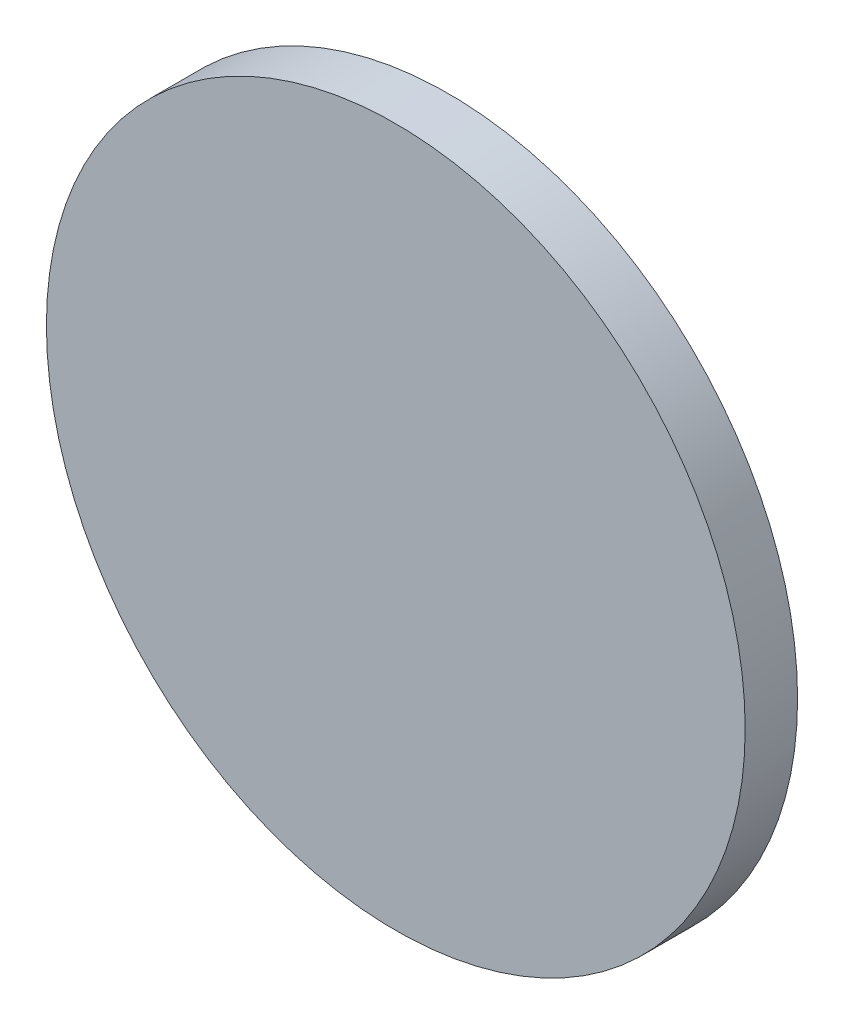
ISO-10303-21;
HEADER;
FILE_DESCRIPTION(('STEP AP214'),'2;1');
FILE_NAME('part.step','',(''),(''),'','','');
FILE_SCHEMA(('AUTOMOTIVE_DESIGN { 1 0 10303 214 1 1 1 1 }'));
ENDSEC;
DATA;
#1=APPLICATION_CONTEXT('core data for automotive mechanical design processes');
#2=APPLICATION_PROTOCOL_DEFINITION('international standard','automotive_design',2000,#1);
#3=PRODUCT_CONTEXT('',#1,'mechanical');
#4=PRODUCT('Part','Part','',(#3));
#5=PRODUCT_RELATED_PRODUCT_CATEGORY('part','',(#4));
#6=PRODUCT_DEFINITION_FORMATION('','',#4);
#7=PRODUCT_DEFINITION_CONTEXT('part definition',#1,'design');
#8=PRODUCT_DEFINITION('design','',#6,#7);
#9=PRODUCT_DEFINITION_SHAPE('','',#8);
#10=(LENGTH_UNIT() NAMED_UNIT(*) SI_UNIT(.MILLI.,.METRE.));
#11=(NAMED_UNIT(*) PLANE_ANGLE_UNIT() SI_UNIT($,.RADIAN.));
#12=(NAMED_UNIT(*) SI_UNIT($,.STERADIAN.) SOLID_ANGLE_UNIT());
#13=UNCERTAINTY_MEASURE_WITH_UNIT(LENGTH_MEASURE(1.E-05),#10,'distance_accuracy_value','');
#14=(GEOMETRIC_REPRESENTATION_CONTEXT(3) GLOBAL_UNCERTAINTY_ASSIGNED_CONTEXT((#13)) GLOBAL_UNIT_ASSIGNED_CONTEXT((#10,
#11,#12)) REPRESENTATION_CONTEXT('',''));
#15=CARTESIAN_POINT('',(0.,0.,0.));
#16=DIRECTION('',(0.,0.,1.));
#17=DIRECTION('',(1.,0.,0.));
#18=AXIS2_PLACEMENT_3D('',#15,#16,#17);
#19=CARTESIAN_POINT('',(8.34916,13.13491,0.76487));
#20=DIRECTION('',(0.,0.,-1.));
#21=DIRECTION('',(-1.,0.,0.));
#22=AXIS2_PLACEMENT_3D('',#19,#20,#21);
#23=PLANE('',#22);
#24=CARTESIAN_POINT('',(8.34916,13.13491,0.76487));
#25=DIRECTION('',(0.,0.,1.));
#26=DIRECTION('',(1.,0.,0.));
#27=AXIS2_PLACEMENT_3D('',#24,#25,#26);
#28=CIRCLE('',#27,0.2286);
#29=CARTESIAN_POINT('',(8.57776,13.13491,0.76487));
#30=VERTEX_POINT('',#29);
#31=EDGE_CURVE('E18',#30,#30,#28,.T.);
#32=ORIENTED_EDGE('',*,*,#31,.F.);
#33=EDGE_LOOP('',(#32));
#34=FACE_BOUND('',#33,.T.);
#35=ADVANCED_FACE('F15',(#34),#23,.T.);
#36=CARTESIAN_POINT('',(8.34916,13.13491,0.76487));
#37=DIRECTION('',(0.,0.,1.));
#38=DIRECTION('',(1.,0.,0.));
#39=AXIS2_PLACEMENT_3D('',#36,#37,#38);
#40=CYLINDRICAL_SURFACE('',#39,0.2286);
#41=CARTESIAN_POINT('',(8.34916,13.13491,0.79916));
#42=DIRECTION('',(0.,0.,1.));
#43=DIRECTION('',(1.,0.,0.));
#44=AXIS2_PLACEMENT_3D('',#41,#42,#43);
#45=CIRCLE('',#44,0.2286);
#46=CARTESIAN_POINT('',(8.57776,13.13491,0.79916));
#47=VERTEX_POINT('',#46);
#48=EDGE_CURVE('E10',#47,#47,#45,.T.);
#49=ORIENTED_EDGE('',*,*,#48,.F.);
#50=EDGE_LOOP('',(#49));
#51=FACE_BOUND('',#50,.T.);
#52=ORIENTED_EDGE('',*,*,#31,.T.);
#53=EDGE_LOOP('',(#52));
#54=FACE_BOUND('',#53,.T.);
#55=ADVANCED_FACE('F27',(#51,#54),#40,.T.);
#56=CARTESIAN_POINT('',(8.34916,13.13491,0.79916));
#57=DIRECTION('',(0.,0.,1.));
#58=DIRECTION('',(1.,0.,0.));
#59=AXIS2_PLACEMENT_3D('',#56,#57,#58);
#60=PLANE('',#59);
#61=ORIENTED_EDGE('',*,*,#48,.T.);
#62=EDGE_LOOP('',(#61));
#63=FACE_BOUND('',#62,.T.);
#64=ADVANCED_FACE('F34',(#63),#60,.T.);
#65=CLOSED_SHELL('',(#35,#55,#64));
#66=MANIFOLD_SOLID_BREP('B1',#65);
#67=ADVANCED_BREP_SHAPE_REPRESENTATION('',(#18,#66),#14);
#68=SHAPE_DEFINITION_REPRESENTATION(#9,#67);
ENDSEC;
END-ISO-10303-21;
